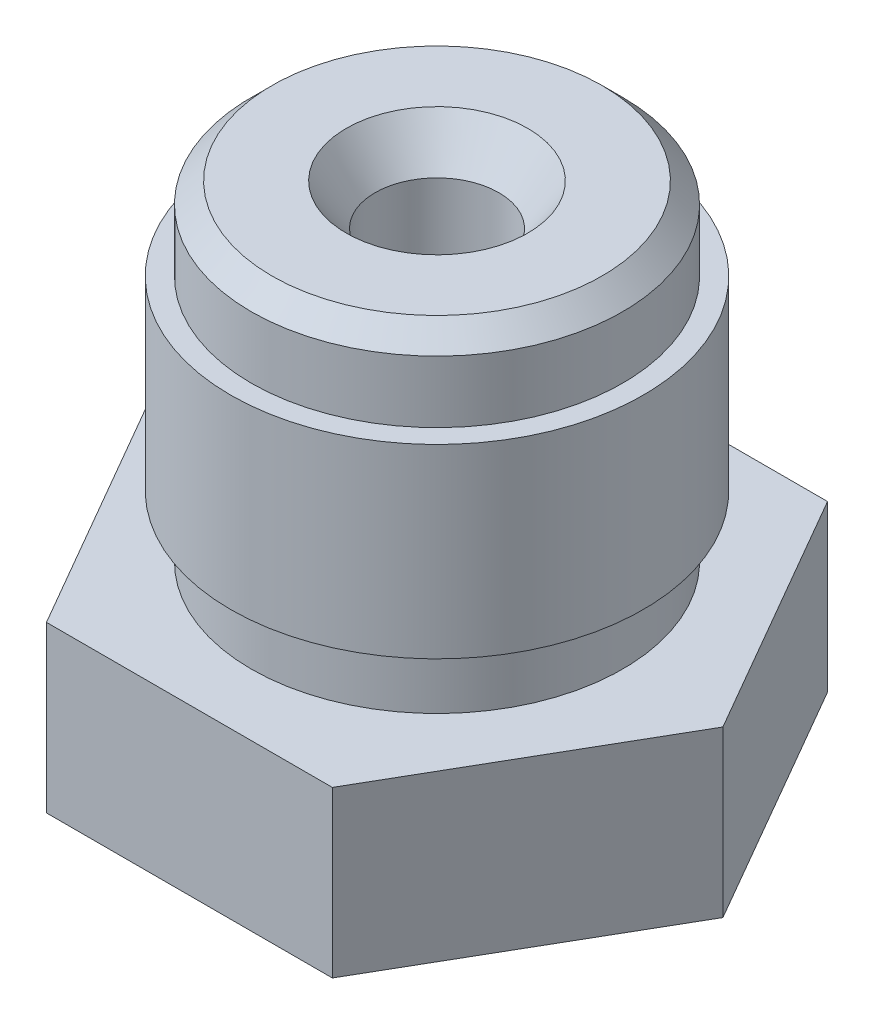
ISO-10303-21;
HEADER;
FILE_DESCRIPTION(('STEP AP214'),'2;1');
FILE_NAME('part.step','',(''),(''),'','','');
FILE_SCHEMA(('AUTOMOTIVE_DESIGN { 1 0 10303 214 1 1 1 1 }'));
ENDSEC;
DATA;
#1=APPLICATION_CONTEXT('core data for automotive mechanical design processes');
#2=APPLICATION_PROTOCOL_DEFINITION('international standard','automotive_design',2000,#1);
#3=PRODUCT_CONTEXT('',#1,'mechanical');
#4=PRODUCT('Part','Part','',(#3));
#5=PRODUCT_RELATED_PRODUCT_CATEGORY('part','',(#4));
#6=PRODUCT_DEFINITION_FORMATION('','',#4);
#7=PRODUCT_DEFINITION_CONTEXT('part definition',#1,'design');
#8=PRODUCT_DEFINITION('design','',#6,#7);
#9=PRODUCT_DEFINITION_SHAPE('','',#8);
#10=(LENGTH_UNIT() NAMED_UNIT(*) SI_UNIT(.MILLI.,.METRE.));
#11=(NAMED_UNIT(*) PLANE_ANGLE_UNIT() SI_UNIT($,.RADIAN.));
#12=(NAMED_UNIT(*) SI_UNIT($,.STERADIAN.) SOLID_ANGLE_UNIT());
#13=UNCERTAINTY_MEASURE_WITH_UNIT(LENGTH_MEASURE(1.E-05),#10,'distance_accuracy_value','');
#14=(GEOMETRIC_REPRESENTATION_CONTEXT(3) GLOBAL_UNCERTAINTY_ASSIGNED_CONTEXT((#13)) GLOBAL_UNIT_ASSIGNED_CONTEXT((#10,
#11,#12)) REPRESENTATION_CONTEXT('',''));
#15=CARTESIAN_POINT('',(0.,0.,0.));
#16=DIRECTION('',(0.,0.,1.));
#17=DIRECTION('',(1.,0.,0.));
#18=AXIS2_PLACEMENT_3D('',#15,#16,#17);
#19=CARTESIAN_POINT('',(0.4,-3.5,0.));
#20=DIRECTION('',(0.,-1.,0.));
#21=DIRECTION('',(0.,0.,-1.));
#22=AXIS2_PLACEMENT_3D('',#19,#20,#21);
#23=PLANE('',#22);
#24=CARTESIAN_POINT('',(0.,-3.5,0.));
#25=DIRECTION('',(0.,-1.,0.));
#26=DIRECTION('',(0.,0.,-1.));
#27=AXIS2_PLACEMENT_3D('',#24,#25,#26);
#28=CIRCLE('',#27,0.4);
#29=CARTESIAN_POINT('',(0.,-3.5,-0.4));
#30=VERTEX_POINT('',#29);
#31=EDGE_CURVE('E125',#30,#30,#28,.T.);
#32=ORIENTED_EDGE('',*,*,#31,.T.);
#33=EDGE_LOOP('',(#32));
#34=FACE_BOUND('',#33,.T.);
#35=CARTESIAN_POINT('',(0.,-3.5,0.));
#36=DIRECTION('',(0.,-1.,0.));
#37=DIRECTION('',(0.,0.,-1.));
#38=AXIS2_PLACEMENT_3D('',#35,#36,#37);
#39=CIRCLE('',#38,0.2);
#40=CARTESIAN_POINT('',(0.,-3.5,-0.2));
#41=VERTEX_POINT('',#40);
#42=EDGE_CURVE('E159',#41,#41,#39,.T.);
#43=ORIENTED_EDGE('',*,*,#42,.F.);
#44=EDGE_LOOP('',(#43));
#45=FACE_BOUND('',#44,.T.);
#46=ADVANCED_FACE('F33',(#34,#45),#23,.T.);
#47=CARTESIAN_POINT('',(0.,-3.5,0.));
#48=DIRECTION('',(0.,-1.,0.));
#49=DIRECTION('',(0.,0.,-1.));
#50=AXIS2_PLACEMENT_3D('',#47,#48,#49);
#51=CYLINDRICAL_SURFACE('',#50,0.2);
#52=ORIENTED_EDGE('',*,*,#42,.T.);
#53=EDGE_LOOP('',(#52));
#54=FACE_BOUND('',#53,.T.);
#55=CARTESIAN_POINT('',(0.,-2.9,0.));
#56=DIRECTION('',(0.,-1.,0.));
#57=DIRECTION('',(0.,0.,-1.));
#58=AXIS2_PLACEMENT_3D('',#55,#56,#57);
#59=CIRCLE('',#58,0.2);
#60=CARTESIAN_POINT('',(0.,-2.9,-0.2));
#61=VERTEX_POINT('',#60);
#62=EDGE_CURVE('E156',#61,#61,#59,.T.);
#63=ORIENTED_EDGE('',*,*,#62,.F.);
#64=EDGE_LOOP('',(#63));
#65=FACE_BOUND('',#64,.T.);
#66=ADVANCED_FACE('F177',(#54,#65),#51,.F.);
#67=CARTESIAN_POINT('',(0.,-1.94737205583712,0.));
#68=DIRECTION('',(0.,1.,0.));
#69=DIRECTION('',(0.,0.,1.));
#70=AXIS2_PLACEMENT_3D('',#67,#68,#69);
#71=CONICAL_SURFACE('',#70,0.75,0.5235987755983);
#72=ORIENTED_EDGE('',*,*,#62,.T.);
#73=EDGE_LOOP('',(#72));
#74=FACE_BOUND('',#73,.T.);
#75=CARTESIAN_POINT('',(0.,-1.94737205583712,0.));
#76=DIRECTION('',(0.,-1.,0.));
#77=DIRECTION('',(0.,0.,-1.));
#78=AXIS2_PLACEMENT_3D('',#75,#76,#77);
#79=CIRCLE('',#78,0.75);
#80=CARTESIAN_POINT('',(0.,-1.94737205583712,-0.75));
#81=VERTEX_POINT('',#80);
#82=EDGE_CURVE('E153',#81,#81,#79,.T.);
#83=ORIENTED_EDGE('',*,*,#82,.F.);
#84=EDGE_LOOP('',(#83));
#85=FACE_BOUND('',#84,.T.);
#86=ADVANCED_FACE('F182',(#74,#85),#71,.F.);
#87=CARTESIAN_POINT('',(0.,-3.5,0.));
#88=DIRECTION('',(0.,-1.,0.));
#89=DIRECTION('',(0.,0.,-1.));
#90=AXIS2_PLACEMENT_3D('',#87,#88,#89);
#91=CYLINDRICAL_SURFACE('',#90,0.75);
#92=ORIENTED_EDGE('',*,*,#82,.T.);
#93=EDGE_LOOP('',(#92));
#94=FACE_BOUND('',#93,.T.);
#95=CARTESIAN_POINT('',(0.,3.,0.));
#96=DIRECTION('',(0.,-1.,0.));
#97=DIRECTION('',(0.,0.,-1.));
#98=AXIS2_PLACEMENT_3D('',#95,#96,#97);
#99=CIRCLE('',#98,0.75);
#100=CARTESIAN_POINT('',(0.,3.,-0.75));
#101=VERTEX_POINT('',#100);
#102=EDGE_CURVE('E150',#101,#101,#99,.T.);
#103=ORIENTED_EDGE('',*,*,#102,.F.);
#104=EDGE_LOOP('',(#103));
#105=FACE_BOUND('',#104,.T.);
#106=ADVANCED_FACE('F189',(#94,#105),#91,.F.);
#107=CARTESIAN_POINT('',(0.,3.5,0.));
#108=DIRECTION('',(0.,1.,0.));
#109=DIRECTION('',(0.,0.,1.));
#110=AXIS2_PLACEMENT_3D('',#107,#108,#109);
#111=CONICAL_SURFACE('',#110,1.10010376910485,0.610865238198013);
#112=ORIENTED_EDGE('',*,*,#102,.T.);
#113=EDGE_LOOP('',(#112));
#114=FACE_BOUND('',#113,.T.);
#115=CARTESIAN_POINT('',(0.,3.5,0.));
#116=DIRECTION('',(0.,-1.,0.));
#117=DIRECTION('',(0.,0.,-1.));
#118=AXIS2_PLACEMENT_3D('',#115,#116,#117);
#119=CIRCLE('',#118,1.10010376910485);
#120=CARTESIAN_POINT('',(0.,3.5,-1.10010376910485));
#121=VERTEX_POINT('',#120);
#122=EDGE_CURVE('E147',#121,#121,#119,.T.);
#123=ORIENTED_EDGE('',*,*,#122,.F.);
#124=EDGE_LOOP('',(#123));
#125=FACE_BOUND('',#124,.T.);
#126=ADVANCED_FACE('F193',(#114,#125),#111,.F.);
#127=CARTESIAN_POINT('',(1.10010376910485,3.5,0.));
#128=DIRECTION('',(0.,1.,0.));
#129=DIRECTION('',(0.,0.,1.));
#130=AXIS2_PLACEMENT_3D('',#127,#128,#129);
#131=PLANE('',#130);
#132=CARTESIAN_POINT('',(0.,3.5,0.));
#133=DIRECTION('',(0.,1.,0.));
#134=DIRECTION('',(0.,0.,1.));
#135=AXIS2_PLACEMENT_3D('',#132,#133,#134);
#136=CIRCLE('',#135,2.);
#137=CARTESIAN_POINT('',(0.,3.5,2.));
#138=VERTEX_POINT('',#137);
#139=EDGE_CURVE('E11',#138,#138,#136,.T.);
#140=ORIENTED_EDGE('',*,*,#139,.T.);
#141=EDGE_LOOP('',(#140));
#142=FACE_BOUND('',#141,.T.);
#143=ORIENTED_EDGE('',*,*,#122,.T.);
#144=EDGE_LOOP('',(#143));
#145=FACE_BOUND('',#144,.T.);
#146=ADVANCED_FACE('F197',(#142,#145),#131,.T.);
#147=CARTESIAN_POINT('',(0.,-3.5,0.));
#148=DIRECTION('',(0.,-1.,0.));
#149=DIRECTION('',(0.,0.,-1.));
#150=AXIS2_PLACEMENT_3D('',#147,#148,#149);
#151=CYLINDRICAL_SURFACE('',#150,2.25);
#152=CARTESIAN_POINT('',(0.,3.25,0.));
#153=DIRECTION('',(0.,1.,0.));
#154=DIRECTION('',(0.,0.,1.));
#155=AXIS2_PLACEMENT_3D('',#152,#153,#154);
#156=CIRCLE('',#155,2.25);
#157=CARTESIAN_POINT('',(0.,3.25,2.25));
#158=VERTEX_POINT('',#157);
#159=EDGE_CURVE('E41',#158,#158,#156,.F.);
#160=ORIENTED_EDGE('',*,*,#159,.T.);
#161=EDGE_LOOP('',(#160));
#162=FACE_BOUND('',#161,.T.);
#163=CARTESIAN_POINT('',(0.,2.5,0.));
#164=DIRECTION('',(0.,-1.,0.));
#165=DIRECTION('',(0.,0.,-1.));
#166=AXIS2_PLACEMENT_3D('',#163,#164,#165);
#167=CIRCLE('',#166,2.25);
#168=CARTESIAN_POINT('',(0.,2.5,-2.25));
#169=VERTEX_POINT('',#168);
#170=EDGE_CURVE('E144',#169,#169,#167,.T.);
#171=ORIENTED_EDGE('',*,*,#170,.F.);
#172=EDGE_LOOP('',(#171));
#173=FACE_BOUND('',#172,.T.);
#174=ADVANCED_FACE('F164',(#162,#173),#151,.T.);
#175=CARTESIAN_POINT('',(2.25,2.5,0.));
#176=DIRECTION('',(0.,1.,0.));
#177=DIRECTION('',(0.,0.,1.));
#178=AXIS2_PLACEMENT_3D('',#175,#176,#177);
#179=PLANE('',#178);
#180=ORIENTED_EDGE('',*,*,#170,.T.);
#181=EDGE_LOOP('',(#180));
#182=FACE_BOUND('',#181,.T.);
#183=CARTESIAN_POINT('',(0.,2.5,0.));
#184=DIRECTION('',(0.,-1.,0.));
#185=DIRECTION('',(0.,0.,-1.));
#186=AXIS2_PLACEMENT_3D('',#183,#184,#185);
#187=CIRCLE('',#186,2.5);
#188=CARTESIAN_POINT('',(0.,2.5,-2.5));
#189=VERTEX_POINT('',#188);
#190=EDGE_CURVE('E141',#189,#189,#187,.T.);
#191=ORIENTED_EDGE('',*,*,#190,.F.);
#192=EDGE_LOOP('',(#191));
#193=FACE_BOUND('',#192,.T.);
#194=ADVANCED_FACE('F204',(#182,#193),#179,.T.);
#195=CARTESIAN_POINT('',(0.,-3.5,0.));
#196=DIRECTION('',(0.,-1.,0.));
#197=DIRECTION('',(0.,0.,-1.));
#198=AXIS2_PLACEMENT_3D('',#195,#196,#197);
#199=CYLINDRICAL_SURFACE('',#198,2.5);
#200=ORIENTED_EDGE('',*,*,#190,.T.);
#201=EDGE_LOOP('',(#200));
#202=FACE_BOUND('',#201,.T.);
#203=CARTESIAN_POINT('',(0.,0.25,0.));
#204=DIRECTION('',(0.,-1.,0.));
#205=DIRECTION('',(0.,0.,-1.));
#206=AXIS2_PLACEMENT_3D('',#203,#204,#205);
#207=CIRCLE('',#206,2.5);
#208=CARTESIAN_POINT('',(0.,0.25,-2.5));
#209=VERTEX_POINT('',#208);
#210=EDGE_CURVE('E138',#209,#209,#207,.T.);
#211=ORIENTED_EDGE('',*,*,#210,.F.);
#212=EDGE_LOOP('',(#211));
#213=FACE_BOUND('',#212,.T.);
#214=ADVANCED_FACE('F207',(#202,#213),#199,.T.);
#215=CARTESIAN_POINT('',(2.25,0.25,0.));
#216=DIRECTION('',(0.,-1.,0.));
#217=DIRECTION('',(0.,0.,-1.));
#218=AXIS2_PLACEMENT_3D('',#215,#216,#217);
#219=PLANE('',#218);
#220=ORIENTED_EDGE('',*,*,#210,.T.);
#221=EDGE_LOOP('',(#220));
#222=FACE_BOUND('',#221,.T.);
#223=CARTESIAN_POINT('',(0.,0.25,0.));
#224=DIRECTION('',(0.,-1.,0.));
#225=DIRECTION('',(0.,0.,-1.));
#226=AXIS2_PLACEMENT_3D('',#223,#224,#225);
#227=CIRCLE('',#226,2.25);
#228=CARTESIAN_POINT('',(0.,0.25,-2.25));
#229=VERTEX_POINT('',#228);
#230=EDGE_CURVE('E135',#229,#229,#227,.T.);
#231=ORIENTED_EDGE('',*,*,#230,.F.);
#232=EDGE_LOOP('',(#231));
#233=FACE_BOUND('',#232,.T.);
#234=ADVANCED_FACE('F211',(#222,#233),#219,.T.);
#235=CARTESIAN_POINT('',(0.,-3.5,0.));
#236=DIRECTION('',(0.,-1.,0.));
#237=DIRECTION('',(0.,0.,-1.));
#238=AXIS2_PLACEMENT_3D('',#235,#236,#237);
#239=CYLINDRICAL_SURFACE('',#238,2.25);
#240=ORIENTED_EDGE('',*,*,#230,.T.);
#241=EDGE_LOOP('',(#240));
#242=FACE_BOUND('',#241,.T.);
#243=CARTESIAN_POINT('',(0.,-0.5,0.));
#244=DIRECTION('',(0.,-1.,0.));
#245=DIRECTION('',(0.,0.,-1.));
#246=AXIS2_PLACEMENT_3D('',#243,#244,#245);
#247=CIRCLE('',#246,2.25);
#248=CARTESIAN_POINT('',(0.,-0.5,-2.25));
#249=VERTEX_POINT('',#248);
#250=EDGE_CURVE('E132',#249,#249,#247,.T.);
#251=ORIENTED_EDGE('',*,*,#250,.F.);
#252=EDGE_LOOP('',(#251));
#253=FACE_BOUND('',#252,.T.);
#254=ADVANCED_FACE('F215',(#242,#253),#239,.T.);
#255=CARTESIAN_POINT('',(2.25,-0.5,0.));
#256=DIRECTION('',(0.,1.,0.));
#257=DIRECTION('',(0.,0.,1.));
#258=AXIS2_PLACEMENT_3D('',#255,#256,#257);
#259=PLANE('',#258);
#260=DIRECTION('',(-0.5,0.,0.866025403784438));
#261=VECTOR('',#260,1.);
#262=CARTESIAN_POINT('',(3.46410161513776,-0.5,0.));
#263=LINE('',#262,#261);
#264=CARTESIAN_POINT('',(3.46410161513776,-0.5,0.));
#265=VERTEX_POINT('',#264);
#266=CARTESIAN_POINT('',(1.73205080756888,-0.5,3.));
#267=VERTEX_POINT('',#266);
#268=EDGE_CURVE('E48',#265,#267,#263,.T.);
#269=ORIENTED_EDGE('',*,*,#268,.F.);
#270=DIRECTION('',(0.5,0.,0.866025403784439));
#271=VECTOR('',#270,1.);
#272=CARTESIAN_POINT('',(1.73205080756888,-0.5,-3.));
#273=LINE('',#272,#271);
#274=CARTESIAN_POINT('',(1.73205080756888,-0.5,-3.));
#275=VERTEX_POINT('',#274);
#276=EDGE_CURVE('E105',#275,#265,#273,.T.);
#277=ORIENTED_EDGE('',*,*,#276,.F.);
#278=DIRECTION('',(1.,0.,0.));
#279=VECTOR('',#278,1.);
#280=CARTESIAN_POINT('',(-1.73205080756888,-0.5,-3.));
#281=LINE('',#280,#279);
#282=CARTESIAN_POINT('',(-1.73205080756888,-0.5,-3.));
#283=VERTEX_POINT('',#282);
#284=EDGE_CURVE('E102',#283,#275,#281,.T.);
#285=ORIENTED_EDGE('',*,*,#284,.F.);
#286=DIRECTION('',(0.5,0.,-0.866025403784439));
#287=VECTOR('',#286,1.);
#288=CARTESIAN_POINT('',(-3.46410161513775,-0.5,0.));
#289=LINE('',#288,#287);
#290=CARTESIAN_POINT('',(-3.46410161513775,-0.5,0.));
#291=VERTEX_POINT('',#290);
#292=EDGE_CURVE('E90',#291,#283,#289,.T.);
#293=ORIENTED_EDGE('',*,*,#292,.F.);
#294=DIRECTION('',(-0.5,0.,-0.866025403784439));
#295=VECTOR('',#294,1.);
#296=CARTESIAN_POINT('',(-1.73205080756888,-0.5,3.));
#297=LINE('',#296,#295);
#298=CARTESIAN_POINT('',(-1.73205080756888,-0.5,3.));
#299=VERTEX_POINT('',#298);
#300=EDGE_CURVE('E113',#299,#291,#297,.T.);
#301=ORIENTED_EDGE('',*,*,#300,.F.);
#302=DIRECTION('',(-1.,0.,0.));
#303=VECTOR('',#302,1.);
#304=CARTESIAN_POINT('',(1.73205080756888,-0.5,3.));
#305=LINE('',#304,#303);
#306=EDGE_CURVE('E56',#267,#299,#305,.T.);
#307=ORIENTED_EDGE('',*,*,#306,.F.);
#308=EDGE_LOOP('',(#269,#277,#285,#293,#301,#307));
#309=FACE_BOUND('',#308,.T.);
#310=ORIENTED_EDGE('',*,*,#250,.T.);
#311=EDGE_LOOP('',(#310));
#312=FACE_BOUND('',#311,.T.);
#313=ADVANCED_FACE('F103',(#309,#312),#259,.T.);
#314=CARTESIAN_POINT('',(3.,-2.5,0.));
#315=DIRECTION('',(0.,-1.,0.));
#316=DIRECTION('',(0.,0.,-1.));
#317=AXIS2_PLACEMENT_3D('',#314,#315,#316);
#318=PLANE('',#317);
#319=DIRECTION('',(-0.5,0.,-0.866025403784439));
#320=VECTOR('',#319,1.);
#321=CARTESIAN_POINT('',(-1.73205080756888,-2.5,3.));
#322=LINE('',#321,#320);
#323=CARTESIAN_POINT('',(-1.73205080756888,-2.5,3.));
#324=VERTEX_POINT('',#323);
#325=CARTESIAN_POINT('',(-3.46410161513775,-2.5,0.));
#326=VERTEX_POINT('',#325);
#327=EDGE_CURVE('E261',#324,#326,#322,.T.);
#328=ORIENTED_EDGE('',*,*,#327,.T.);
#329=DIRECTION('',(0.5,0.,-0.866025403784438));
#330=VECTOR('',#329,1.);
#331=CARTESIAN_POINT('',(-3.46410161513775,-2.5,0.));
#332=LINE('',#331,#330);
#333=CARTESIAN_POINT('',(-1.73205080756888,-2.5,-3.));
#334=VERTEX_POINT('',#333);
#335=EDGE_CURVE('E263',#326,#334,#332,.T.);
#336=ORIENTED_EDGE('',*,*,#335,.T.);
#337=DIRECTION('',(1.,0.,0.));
#338=VECTOR('',#337,1.);
#339=CARTESIAN_POINT('',(-1.73205080756888,-2.5,-3.));
#340=LINE('',#339,#338);
#341=CARTESIAN_POINT('',(1.73205080756888,-2.5,-3.));
#342=VERTEX_POINT('',#341);
#343=EDGE_CURVE('E112',#334,#342,#340,.T.);
#344=ORIENTED_EDGE('',*,*,#343,.T.);
#345=DIRECTION('',(0.5,0.,0.866025403784439));
#346=VECTOR('',#345,1.);
#347=CARTESIAN_POINT('',(1.73205080756888,-2.5,-3.));
#348=LINE('',#347,#346);
#349=CARTESIAN_POINT('',(3.46410161513776,-2.5,0.));
#350=VERTEX_POINT('',#349);
#351=EDGE_CURVE('E129',#342,#350,#348,.T.);
#352=ORIENTED_EDGE('',*,*,#351,.T.);
#353=DIRECTION('',(-0.5,0.,0.866025403784438));
#354=VECTOR('',#353,1.);
#355=CARTESIAN_POINT('',(3.46410161513776,-2.5,0.));
#356=LINE('',#355,#354);
#357=CARTESIAN_POINT('',(1.73205080756888,-2.5,3.));
#358=VERTEX_POINT('',#357);
#359=EDGE_CURVE('E122',#350,#358,#356,.T.);
#360=ORIENTED_EDGE('',*,*,#359,.T.);
#361=DIRECTION('',(-1.,0.,0.));
#362=VECTOR('',#361,1.);
#363=CARTESIAN_POINT('',(1.73205080756888,-2.5,3.));
#364=LINE('',#363,#362);
#365=EDGE_CURVE('E248',#358,#324,#364,.T.);
#366=ORIENTED_EDGE('',*,*,#365,.T.);
#367=EDGE_LOOP('',(#328,#336,#344,#352,#360,#366));
#368=FACE_BOUND('',#367,.T.);
#369=CARTESIAN_POINT('',(0.,-2.5,0.));
#370=DIRECTION('',(0.,-1.,0.));
#371=DIRECTION('',(0.,0.,-1.));
#372=AXIS2_PLACEMENT_3D('',#369,#370,#371);
#373=CIRCLE('',#372,1.10020753820971);
#374=CARTESIAN_POINT('',(0.,-2.5,-1.10020753820971));
#375=VERTEX_POINT('',#374);
#376=EDGE_CURVE('E128',#375,#375,#373,.T.);
#377=ORIENTED_EDGE('',*,*,#376,.F.);
#378=EDGE_LOOP('',(#377));
#379=FACE_BOUND('',#378,.T.);
#380=ADVANCED_FACE('F222',(#368,#379),#318,.T.);
#381=CARTESIAN_POINT('',(0.,-3.5,0.));
#382=DIRECTION('',(0.,1.,0.));
#383=DIRECTION('',(0.,0.,1.));
#384=AXIS2_PLACEMENT_3D('',#381,#382,#383);
#385=CONICAL_SURFACE('',#384,0.4,0.610865238198012);
#386=ORIENTED_EDGE('',*,*,#376,.T.);
#387=EDGE_LOOP('',(#386));
#388=FACE_BOUND('',#387,.T.);
#389=ORIENTED_EDGE('',*,*,#31,.F.);
#390=EDGE_LOOP('',(#389));
#391=FACE_BOUND('',#390,.T.);
#392=ADVANCED_FACE('F225',(#388,#391),#385,.T.);
#393=CARTESIAN_POINT('',(3.46410161513776,8.66515138991168,0.));
#394=DIRECTION('',(0.866025403784438,0.,0.5));
#395=DIRECTION('',(0.5,0.,-0.866025403784438));
#396=AXIS2_PLACEMENT_3D('',#393,#394,#395);
#397=PLANE('',#396);
#398=ORIENTED_EDGE('',*,*,#268,.T.);
#399=DIRECTION('',(0.,-1.,0.));
#400=VECTOR('',#399,1.);
#401=CARTESIAN_POINT('',(1.73205080756888,8.66515138991168,3.));
#402=LINE('',#401,#400);
#403=EDGE_CURVE('E123',#267,#358,#402,.T.);
#404=ORIENTED_EDGE('',*,*,#403,.T.);
#405=ORIENTED_EDGE('',*,*,#359,.F.);
#406=DIRECTION('',(0.,-1.,0.));
#407=VECTOR('',#406,1.);
#408=CARTESIAN_POINT('',(3.46410161513776,8.66515138991168,0.));
#409=LINE('',#408,#407);
#410=EDGE_CURVE('E109',#265,#350,#409,.T.);
#411=ORIENTED_EDGE('',*,*,#410,.F.);
#412=EDGE_LOOP('',(#398,#404,#405,#411));
#413=FACE_BOUND('',#412,.T.);
#414=ADVANCED_FACE('F229',(#413),#397,.T.);
#415=CARTESIAN_POINT('',(1.73205080756888,8.66515138991168,-3.));
#416=DIRECTION('',(0.866025403784439,0.,-0.5));
#417=DIRECTION('',(-0.5,0.,-0.866025403784439));
#418=AXIS2_PLACEMENT_3D('',#415,#416,#417);
#419=PLANE('',#418);
#420=ORIENTED_EDGE('',*,*,#276,.T.);
#421=ORIENTED_EDGE('',*,*,#410,.T.);
#422=ORIENTED_EDGE('',*,*,#351,.F.);
#423=DIRECTION('',(0.,-1.,0.));
#424=VECTOR('',#423,1.);
#425=CARTESIAN_POINT('',(1.73205080756888,8.66515138991168,-3.));
#426=LINE('',#425,#424);
#427=EDGE_CURVE('E99',#275,#342,#426,.T.);
#428=ORIENTED_EDGE('',*,*,#427,.F.);
#429=EDGE_LOOP('',(#420,#421,#422,#428));
#430=FACE_BOUND('',#429,.T.);
#431=ADVANCED_FACE('F233',(#430),#419,.T.);
#432=CARTESIAN_POINT('',(-1.73205080756888,8.66515138991168,-3.));
#433=DIRECTION('',(0.,0.,-1.));
#434=DIRECTION('',(-1.,0.,0.));
#435=AXIS2_PLACEMENT_3D('',#432,#433,#434);
#436=PLANE('',#435);
#437=ORIENTED_EDGE('',*,*,#284,.T.);
#438=ORIENTED_EDGE('',*,*,#427,.T.);
#439=ORIENTED_EDGE('',*,*,#343,.F.);
#440=DIRECTION('',(0.,-1.,0.));
#441=VECTOR('',#440,1.);
#442=CARTESIAN_POINT('',(-1.73205080756888,8.66515138991168,-3.));
#443=LINE('',#442,#441);
#444=EDGE_CURVE('E94',#283,#334,#443,.T.);
#445=ORIENTED_EDGE('',*,*,#444,.F.);
#446=EDGE_LOOP('',(#437,#438,#439,#445));
#447=FACE_BOUND('',#446,.T.);
#448=ADVANCED_FACE('F111',(#447),#436,.T.);
#449=CARTESIAN_POINT('',(-3.46410161513775,8.66515138991168,0.));
#450=DIRECTION('',(-0.866025403784439,0.,-0.5));
#451=DIRECTION('',(-0.5,0.,0.866025403784439));
#452=AXIS2_PLACEMENT_3D('',#449,#450,#451);
#453=PLANE('',#452);
#454=ORIENTED_EDGE('',*,*,#292,.T.);
#455=ORIENTED_EDGE('',*,*,#444,.T.);
#456=ORIENTED_EDGE('',*,*,#335,.F.);
#457=DIRECTION('',(0.,-1.,0.));
#458=VECTOR('',#457,1.);
#459=CARTESIAN_POINT('',(-3.46410161513775,8.66515138991168,0.));
#460=LINE('',#459,#458);
#461=EDGE_CURVE('E97',#291,#326,#460,.T.);
#462=ORIENTED_EDGE('',*,*,#461,.F.);
#463=EDGE_LOOP('',(#454,#455,#456,#462));
#464=FACE_BOUND('',#463,.T.);
#465=ADVANCED_FACE('F92',(#464),#453,.T.);
#466=CARTESIAN_POINT('',(-1.73205080756888,8.66515138991168,3.));
#467=DIRECTION('',(-0.866025403784439,0.,0.5));
#468=DIRECTION('',(0.5,0.,0.866025403784439));
#469=AXIS2_PLACEMENT_3D('',#466,#467,#468);
#470=PLANE('',#469);
#471=ORIENTED_EDGE('',*,*,#300,.T.);
#472=ORIENTED_EDGE('',*,*,#461,.T.);
#473=ORIENTED_EDGE('',*,*,#327,.F.);
#474=DIRECTION('',(0.,-1.,0.));
#475=VECTOR('',#474,1.);
#476=CARTESIAN_POINT('',(-1.73205080756888,8.66515138991168,3.));
#477=LINE('',#476,#475);
#478=EDGE_CURVE('E120',#299,#324,#477,.T.);
#479=ORIENTED_EDGE('',*,*,#478,.F.);
#480=EDGE_LOOP('',(#471,#472,#473,#479));
#481=FACE_BOUND('',#480,.T.);
#482=ADVANCED_FACE('F173',(#481),#470,.T.);
#483=CARTESIAN_POINT('',(1.73205080756888,8.66515138991168,3.));
#484=DIRECTION('',(0.,0.,1.));
#485=DIRECTION('',(1.,0.,0.));
#486=AXIS2_PLACEMENT_3D('',#483,#484,#485);
#487=PLANE('',#486);
#488=ORIENTED_EDGE('',*,*,#306,.T.);
#489=ORIENTED_EDGE('',*,*,#478,.T.);
#490=ORIENTED_EDGE('',*,*,#365,.F.);
#491=ORIENTED_EDGE('',*,*,#403,.F.);
#492=EDGE_LOOP('',(#488,#489,#490,#491));
#493=FACE_BOUND('',#492,.T.);
#494=ADVANCED_FACE('F168',(#493),#487,.T.);
#495=CARTESIAN_POINT('',(0.,3.25,0.));
#496=DIRECTION('',(0.,-1.,0.));
#497=DIRECTION('',(0.,0.,-1.));
#498=AXIS2_PLACEMENT_3D('',#495,#496,#497);
#499=CONICAL_SURFACE('',#498,2.25,0.78539816339745);
#500=ORIENTED_EDGE('',*,*,#139,.F.);
#501=EDGE_LOOP('',(#500));
#502=FACE_BOUND('',#501,.T.);
#503=ORIENTED_EDGE('',*,*,#159,.F.);
#504=EDGE_LOOP('',(#503));
#505=FACE_BOUND('',#504,.T.);
#506=ADVANCED_FACE('F35',(#502,#505),#499,.T.);
#507=CLOSED_SHELL('',(#46,#66,#86,#106,#126,#146,#174,#194,#214,#234,#254,#313,#380,#392,#414,
#431,#448,#465,#482,#494,#506));
#508=MANIFOLD_SOLID_BREP('B2',#507);
#509=ADVANCED_BREP_SHAPE_REPRESENTATION('',(#18,#508),#14);
#510=SHAPE_DEFINITION_REPRESENTATION(#9,#509);
ENDSEC;
END-ISO-10303-21;
